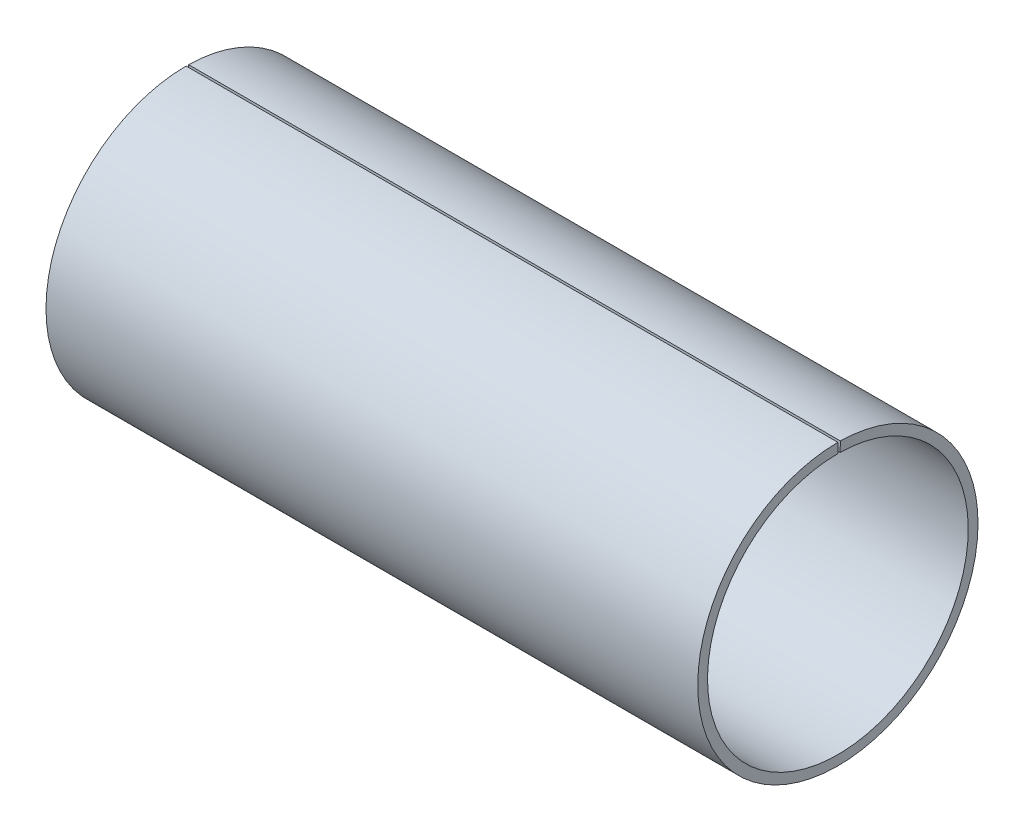
ISO-10303-21;
HEADER;
FILE_DESCRIPTION(('STEP AP214'),'2;1');
FILE_NAME('part.step','',(''),(''),'','','');
FILE_SCHEMA(('AUTOMOTIVE_DESIGN { 1 0 10303 214 1 1 1 1 }'));
ENDSEC;
DATA;
#1=APPLICATION_CONTEXT('core data for automotive mechanical design processes');
#2=APPLICATION_PROTOCOL_DEFINITION('international standard','automotive_design',2000,#1);
#3=PRODUCT_CONTEXT('',#1,'mechanical');
#4=PRODUCT('Part','Part','',(#3));
#5=PRODUCT_RELATED_PRODUCT_CATEGORY('part','',(#4));
#6=PRODUCT_DEFINITION_FORMATION('','',#4);
#7=PRODUCT_DEFINITION_CONTEXT('part definition',#1,'design');
#8=PRODUCT_DEFINITION('design','',#6,#7);
#9=PRODUCT_DEFINITION_SHAPE('','',#8);
#10=(LENGTH_UNIT() NAMED_UNIT(*) SI_UNIT(.MILLI.,.METRE.));
#11=(NAMED_UNIT(*) PLANE_ANGLE_UNIT() SI_UNIT($,.RADIAN.));
#12=(NAMED_UNIT(*) SI_UNIT($,.STERADIAN.) SOLID_ANGLE_UNIT());
#13=UNCERTAINTY_MEASURE_WITH_UNIT(LENGTH_MEASURE(1.E-05),#10,'distance_accuracy_value','');
#14=(GEOMETRIC_REPRESENTATION_CONTEXT(3) GLOBAL_UNCERTAINTY_ASSIGNED_CONTEXT((#13)) GLOBAL_UNIT_ASSIGNED_CONTEXT((#10,
#11,#12)) REPRESENTATION_CONTEXT('',''));
#15=CARTESIAN_POINT('',(0.,0.,0.));
#16=DIRECTION('',(0.,0.,1.));
#17=DIRECTION('',(1.,0.,0.));
#18=AXIS2_PLACEMENT_3D('',#15,#16,#17);
#19=CARTESIAN_POINT('',(-100.,0.,0.));
#20=DIRECTION('',(1.,0.,0.));
#21=DIRECTION('',(0.,0.,-1.));
#22=AXIS2_PLACEMENT_3D('',#19,#20,#21);
#23=CYLINDRICAL_SURFACE('',#22,21.5);
#24=CARTESIAN_POINT('',(0.,0.,0.));
#25=DIRECTION('',(1.,0.,0.));
#26=DIRECTION('',(0.,0.,-1.));
#27=AXIS2_PLACEMENT_3D('',#24,#25,#26);
#28=CIRCLE('',#27,21.5);
#29=CARTESIAN_POINT('',(0.,21.5,0.));
#30=VERTEX_POINT('',#29);
#31=CARTESIAN_POINT('',(0.,21.4967254458624,-0.37522673840144));
#32=VERTEX_POINT('',#31);
#33=EDGE_CURVE('E106',#30,#32,#28,.T.);
#34=ORIENTED_EDGE('',*,*,#33,.F.);
#35=DIRECTION('',(1.,0.,0.));
#36=VECTOR('',#35,1.);
#37=CARTESIAN_POINT('',(-100.,21.5,0.));
#38=LINE('',#37,#36);
#39=CARTESIAN_POINT('',(-100.,21.5,0.));
#40=VERTEX_POINT('',#39);
#41=EDGE_CURVE('E11',#40,#30,#38,.T.);
#42=ORIENTED_EDGE('',*,*,#41,.F.);
#43=CARTESIAN_POINT('',(-100.,0.,0.));
#44=DIRECTION('',(1.,0.,0.));
#45=DIRECTION('',(0.,0.,-1.));
#46=AXIS2_PLACEMENT_3D('',#43,#44,#45);
#47=CIRCLE('',#46,21.5);
#48=CARTESIAN_POINT('',(-100.,21.4967254458624,-0.37522673840144));
#49=VERTEX_POINT('',#48);
#50=EDGE_CURVE('E101',#40,#49,#47,.T.);
#51=ORIENTED_EDGE('',*,*,#50,.T.);
#52=DIRECTION('',(1.,0.,0.));
#53=VECTOR('',#52,1.);
#54=CARTESIAN_POINT('',(-100.,21.4967254458624,-0.37522673840144));
#55=LINE('',#54,#53);
#56=EDGE_CURVE('E44',#49,#32,#55,.T.);
#57=ORIENTED_EDGE('',*,*,#56,.T.);
#58=EDGE_LOOP('',(#34,#42,#51,#57));
#59=FACE_BOUND('',#58,.T.);
#60=ADVANCED_FACE('F41',(#59),#23,.T.);
#61=CARTESIAN_POINT('',(-100.,21.5,0.));
#62=DIRECTION('',(0.,0.,1.));
#63=DIRECTION('',(0.,-1.,0.));
#64=AXIS2_PLACEMENT_3D('',#61,#62,#63);
#65=PLANE('',#64);
#66=DIRECTION('',(0.,-1.,0.));
#67=VECTOR('',#66,1.);
#68=CARTESIAN_POINT('',(0.,21.5,0.));
#69=LINE('',#68,#67);
#70=CARTESIAN_POINT('',(0.,20.,0.));
#71=VERTEX_POINT('',#70);
#72=EDGE_CURVE('E74',#30,#71,#69,.T.);
#73=ORIENTED_EDGE('',*,*,#72,.T.);
#74=DIRECTION('',(1.,0.,0.));
#75=VECTOR('',#74,1.);
#76=CARTESIAN_POINT('',(-100.,20.,0.));
#77=LINE('',#76,#75);
#78=CARTESIAN_POINT('',(-100.,20.,0.));
#79=VERTEX_POINT('',#78);
#80=EDGE_CURVE('E50',#79,#71,#77,.T.);
#81=ORIENTED_EDGE('',*,*,#80,.F.);
#82=DIRECTION('',(0.,-1.,0.));
#83=VECTOR('',#82,1.);
#84=CARTESIAN_POINT('',(-100.,21.5,0.));
#85=LINE('',#84,#83);
#86=EDGE_CURVE('E89',#40,#79,#85,.T.);
#87=ORIENTED_EDGE('',*,*,#86,.F.);
#88=ORIENTED_EDGE('',*,*,#41,.T.);
#89=EDGE_LOOP('',(#73,#81,#87,#88));
#90=FACE_BOUND('',#89,.T.);
#91=ADVANCED_FACE('F116',(#90),#65,.F.);
#92=CARTESIAN_POINT('',(-100.,0.,0.));
#93=DIRECTION('',(1.,0.,0.));
#94=DIRECTION('',(0.,0.,-1.));
#95=AXIS2_PLACEMENT_3D('',#92,#93,#94);
#96=CYLINDRICAL_SURFACE('',#95,20.);
#97=CARTESIAN_POINT('',(0.,0.,0.));
#98=DIRECTION('',(1.,0.,0.));
#99=DIRECTION('',(0.,0.,-1.));
#100=AXIS2_PLACEMENT_3D('',#97,#98,#99);
#101=CIRCLE('',#100,20.);
#102=CARTESIAN_POINT('',(0.,19.9969539031278,-0.349048128745525));
#103=VERTEX_POINT('',#102);
#104=EDGE_CURVE('E96',#71,#103,#101,.T.);
#105=ORIENTED_EDGE('',*,*,#104,.T.);
#106=DIRECTION('',(1.,0.,0.));
#107=VECTOR('',#106,1.);
#108=CARTESIAN_POINT('',(-100.,19.9969539031278,-0.349048128745525));
#109=LINE('',#108,#107);
#110=CARTESIAN_POINT('',(-100.,19.9969539031278,-0.349048128745525));
#111=VERTEX_POINT('',#110);
#112=EDGE_CURVE('E93',#111,#103,#109,.T.);
#113=ORIENTED_EDGE('',*,*,#112,.F.);
#114=CARTESIAN_POINT('',(-100.,0.,0.));
#115=DIRECTION('',(1.,0.,0.));
#116=DIRECTION('',(0.,0.,-1.));
#117=AXIS2_PLACEMENT_3D('',#114,#115,#116);
#118=CIRCLE('',#117,20.);
#119=EDGE_CURVE('E86',#79,#111,#118,.T.);
#120=ORIENTED_EDGE('',*,*,#119,.F.);
#121=ORIENTED_EDGE('',*,*,#80,.T.);
#122=EDGE_LOOP('',(#105,#113,#120,#121));
#123=FACE_BOUND('',#122,.T.);
#124=ADVANCED_FACE('F94',(#123),#96,.F.);
#125=CARTESIAN_POINT('',(-100.,19.9969539031278,-0.349048128745525));
#126=DIRECTION('',(0.,-0.0174524064372762,-0.999847695156391));
#127=DIRECTION('',(0.,0.999847695156391,-0.0174524064372762));
#128=AXIS2_PLACEMENT_3D('',#125,#126,#127);
#129=PLANE('',#128);
#130=DIRECTION('',(0.,0.999847695156391,-0.0174524064372762));
#131=VECTOR('',#130,1.);
#132=CARTESIAN_POINT('',(0.,19.9969539031278,-0.349048128745525));
#133=LINE('',#132,#131);
#134=EDGE_CURVE('E109',#103,#32,#133,.T.);
#135=ORIENTED_EDGE('',*,*,#134,.T.);
#136=ORIENTED_EDGE('',*,*,#56,.F.);
#137=DIRECTION('',(0.,0.999847695156391,-0.0174524064372762));
#138=VECTOR('',#137,1.);
#139=CARTESIAN_POINT('',(-100.,19.9969539031278,-0.349048128745525));
#140=LINE('',#139,#138);
#141=EDGE_CURVE('E83',#111,#49,#140,.T.);
#142=ORIENTED_EDGE('',*,*,#141,.F.);
#143=ORIENTED_EDGE('',*,*,#112,.T.);
#144=EDGE_LOOP('',(#135,#136,#142,#143));
#145=FACE_BOUND('',#144,.T.);
#146=ADVANCED_FACE('F100',(#145),#129,.F.);
#147=CARTESIAN_POINT('',(-100.,0.,0.));
#148=DIRECTION('',(1.,0.,0.));
#149=DIRECTION('',(0.,0.,-1.));
#150=AXIS2_PLACEMENT_3D('',#147,#148,#149);
#151=PLANE('',#150);
#152=ORIENTED_EDGE('',*,*,#50,.F.);
#153=ORIENTED_EDGE('',*,*,#86,.T.);
#154=ORIENTED_EDGE('',*,*,#119,.T.);
#155=ORIENTED_EDGE('',*,*,#141,.T.);
#156=EDGE_LOOP('',(#152,#153,#154,#155));
#157=FACE_BOUND('',#156,.T.);
#158=ADVANCED_FACE('F88',(#157),#151,.F.);
#159=CARTESIAN_POINT('',(0.,0.,0.));
#160=DIRECTION('',(1.,0.,0.));
#161=DIRECTION('',(0.,0.,-1.));
#162=AXIS2_PLACEMENT_3D('',#159,#160,#161);
#163=PLANE('',#162);
#164=ORIENTED_EDGE('',*,*,#33,.T.);
#165=ORIENTED_EDGE('',*,*,#134,.F.);
#166=ORIENTED_EDGE('',*,*,#104,.F.);
#167=ORIENTED_EDGE('',*,*,#72,.F.);
#168=EDGE_LOOP('',(#164,#165,#166,#167));
#169=FACE_BOUND('',#168,.T.);
#170=ADVANCED_FACE('F114',(#169),#163,.T.);
#171=CLOSED_SHELL('',(#60,#91,#124,#146,#158,#170));
#172=MANIFOLD_SOLID_BREP('B2',#171);
#173=ADVANCED_BREP_SHAPE_REPRESENTATION('',(#18,#172),#14);
#174=SHAPE_DEFINITION_REPRESENTATION(#9,#173);
ENDSEC;
END-ISO-10303-21;
